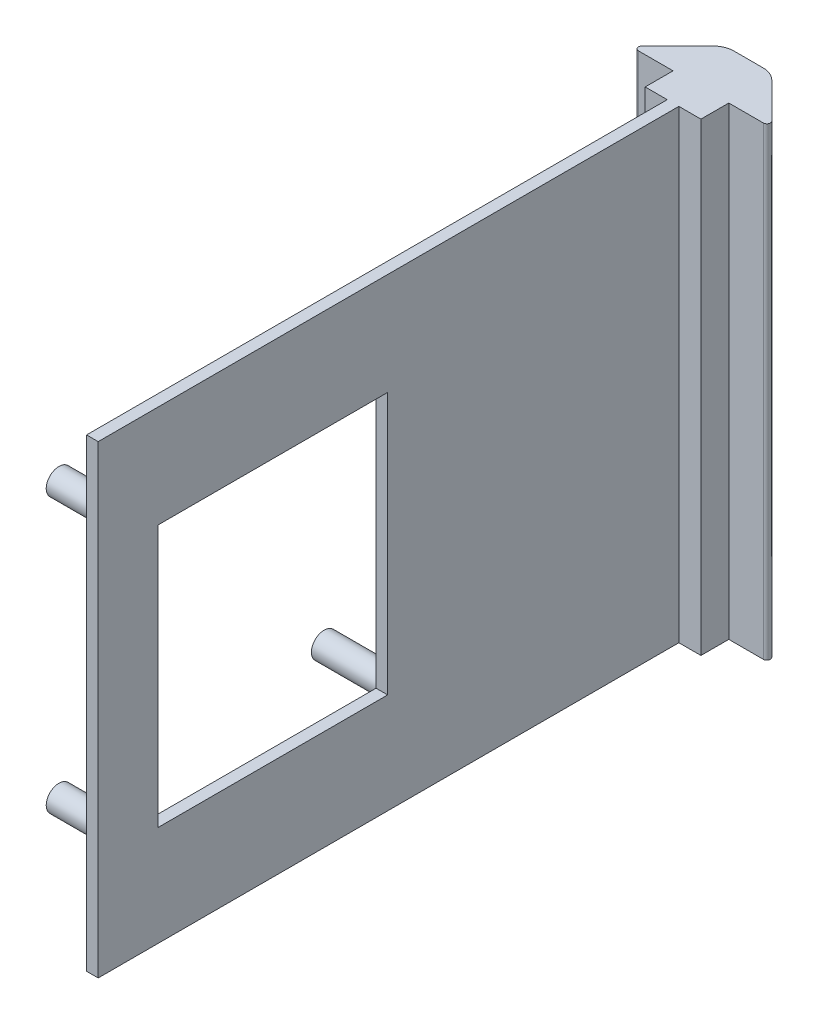
ISO-10303-21;
HEADER;
FILE_DESCRIPTION(('STEP AP214'),'2;1');
FILE_NAME('part.step','',(''),(''),'','','');
FILE_SCHEMA(('AUTOMOTIVE_DESIGN { 1 0 10303 214 1 1 1 1 }'));
ENDSEC;
DATA;
#1=APPLICATION_CONTEXT('core data for automotive mechanical design processes');
#2=APPLICATION_PROTOCOL_DEFINITION('international standard','automotive_design',2000,#1);
#3=PRODUCT_CONTEXT('',#1,'mechanical');
#4=PRODUCT('Part','Part','',(#3));
#5=PRODUCT_RELATED_PRODUCT_CATEGORY('part','',(#4));
#6=PRODUCT_DEFINITION_FORMATION('','',#4);
#7=PRODUCT_DEFINITION_CONTEXT('part definition',#1,'design');
#8=PRODUCT_DEFINITION('design','',#6,#7);
#9=PRODUCT_DEFINITION_SHAPE('','',#8);
#10=(LENGTH_UNIT() NAMED_UNIT(*) SI_UNIT(.MILLI.,.METRE.));
#11=(NAMED_UNIT(*) PLANE_ANGLE_UNIT() SI_UNIT($,.RADIAN.));
#12=(NAMED_UNIT(*) SI_UNIT($,.STERADIAN.) SOLID_ANGLE_UNIT());
#13=UNCERTAINTY_MEASURE_WITH_UNIT(LENGTH_MEASURE(1.E-05),#10,'distance_accuracy_value','');
#14=(GEOMETRIC_REPRESENTATION_CONTEXT(3) GLOBAL_UNCERTAINTY_ASSIGNED_CONTEXT((#13)) GLOBAL_UNIT_ASSIGNED_CONTEXT((#10,
#11,#12)) REPRESENTATION_CONTEXT('',''));
#15=CARTESIAN_POINT('',(0.,0.,0.));
#16=DIRECTION('',(0.,0.,1.));
#17=DIRECTION('',(1.,0.,0.));
#18=AXIS2_PLACEMENT_3D('',#15,#16,#17);
#19=CARTESIAN_POINT('',(-25.9846429608385,222.383078415329,86.0963149930729));
#20=DIRECTION('',(1.,0.,0.));
#21=DIRECTION('',(0.,0.,-1.));
#22=AXIS2_PLACEMENT_3D('',#19,#20,#21);
#23=PLANE('',#22);
#24=DIRECTION('',(0.,0.,-1.));
#25=VECTOR('',#24,1.);
#26=CARTESIAN_POINT('',(-25.9846429608385,273.183078415329,86.0963149930729));
#27=LINE('',#26,#25);
#28=CARTESIAN_POINT('',(-25.9846429608385,273.183078415329,86.0963149930729));
#29=VERTEX_POINT('',#28);
#30=CARTESIAN_POINT('',(-25.9846429608385,273.183078415329,22.5963149930729));
#31=VERTEX_POINT('',#30);
#32=EDGE_CURVE('E231',#29,#31,#27,.T.);
#33=ORIENTED_EDGE('',*,*,#32,.F.);
#34=DIRECTION('',(0.,1.,0.));
#35=VECTOR('',#34,1.);
#36=CARTESIAN_POINT('',(-25.9846429608385,222.383078415329,86.0963149930729));
#37=LINE('',#36,#35);
#38=CARTESIAN_POINT('',(-25.9846429608385,222.383078415329,86.0963149930729));
#39=VERTEX_POINT('',#38);
#40=EDGE_CURVE('E11',#39,#29,#37,.T.);
#41=ORIENTED_EDGE('',*,*,#40,.F.);
#42=DIRECTION('',(0.,0.,-1.));
#43=VECTOR('',#42,1.);
#44=CARTESIAN_POINT('',(-25.9846429608385,222.383078415329,86.0963149930729));
#45=LINE('',#44,#43);
#46=CARTESIAN_POINT('',(-25.9846429608385,222.383078415329,22.5963149930729));
#47=VERTEX_POINT('',#46);
#48=EDGE_CURVE('E234',#39,#47,#45,.T.);
#49=ORIENTED_EDGE('',*,*,#48,.T.);
#50=DIRECTION('',(0.,1.,0.));
#51=VECTOR('',#50,1.);
#52=CARTESIAN_POINT('',(-25.9846429608385,222.383078415329,22.5963149930729));
#53=LINE('',#52,#51);
#54=EDGE_CURVE('E40',#47,#31,#53,.T.);
#55=ORIENTED_EDGE('',*,*,#54,.T.);
#56=EDGE_LOOP('',(#33,#41,#49,#55));
#57=FACE_BOUND('',#56,.T.);
#58=DIRECTION('',(0.,0.,-1.));
#59=VECTOR('',#58,1.);
#60=CARTESIAN_POINT('',(-25.9846429608385,233.365269258809,86.0963149930729));
#61=LINE('',#60,#59);
#62=CARTESIAN_POINT('',(-25.9846429608385,233.365269258809,79.5497436559033));
#63=VERTEX_POINT('',#62);
#64=CARTESIAN_POINT('',(-25.9846429608385,233.365269258809,54.4397436559033));
#65=VERTEX_POINT('',#64);
#66=EDGE_CURVE('E204',#63,#65,#61,.T.);
#67=ORIENTED_EDGE('',*,*,#66,.F.);
#68=DIRECTION('',(0.,1.,0.));
#69=VECTOR('',#68,1.);
#70=CARTESIAN_POINT('',(-25.9846429608385,222.383078415329,79.5497436559033));
#71=LINE('',#70,#69);
#72=CARTESIAN_POINT('',(-25.9846429608385,262.015269258809,79.5497436559033));
#73=VERTEX_POINT('',#72);
#74=EDGE_CURVE('E206',#63,#73,#71,.T.);
#75=ORIENTED_EDGE('',*,*,#74,.T.);
#76=DIRECTION('',(0.,0.,-1.));
#77=VECTOR('',#76,1.);
#78=CARTESIAN_POINT('',(-25.9846429608385,262.015269258809,86.0963149930729));
#79=LINE('',#78,#77);
#80=CARTESIAN_POINT('',(-25.9846429608385,262.015269258809,54.4397436559033));
#81=VERTEX_POINT('',#80);
#82=EDGE_CURVE('E199',#73,#81,#79,.T.);
#83=ORIENTED_EDGE('',*,*,#82,.T.);
#84=DIRECTION('',(0.,1.,0.));
#85=VECTOR('',#84,1.);
#86=CARTESIAN_POINT('',(-25.9846429608385,222.383078415329,54.4397436559033));
#87=LINE('',#86,#85);
#88=EDGE_CURVE('E180',#65,#81,#87,.T.);
#89=ORIENTED_EDGE('',*,*,#88,.F.);
#90=EDGE_LOOP('',(#67,#75,#83,#89));
#91=FACE_BOUND('',#90,.T.);
#92=ADVANCED_FACE('F37',(#57,#91),#23,.T.);
#93=CARTESIAN_POINT('',(-27.2546429608385,222.383078415329,22.5963149930729));
#94=DIRECTION('',(-1.,0.,0.));
#95=DIRECTION('',(0.,0.,1.));
#96=AXIS2_PLACEMENT_3D('',#93,#94,#95);
#97=PLANE('',#96);
#98=CARTESIAN_POINT('',(-27.2546429608385,232.690269258809,81.4947436559033));
#99=DIRECTION('',(-1.,0.,0.));
#100=DIRECTION('',(0.,0.,1.));
#101=AXIS2_PLACEMENT_3D('',#98,#99,#100);
#102=CIRCLE('',#101,1.39700000000001);
#103=CARTESIAN_POINT('',(-27.2546429608385,232.690269258809,82.8917436559033));
#104=VERTEX_POINT('',#103);
#105=EDGE_CURVE('E210',#104,#104,#102,.T.);
#106=ORIENTED_EDGE('',*,*,#105,.F.);
#107=EDGE_LOOP('',(#106));
#108=FACE_BOUND('',#107,.T.);
#109=CARTESIAN_POINT('',(-27.2546429608385,262.69026925881,81.4947436559033));
#110=DIRECTION('',(-1.,0.,0.));
#111=DIRECTION('',(0.,0.,1.));
#112=AXIS2_PLACEMENT_3D('',#109,#110,#111);
#113=CIRCLE('',#112,1.39699999999998);
#114=CARTESIAN_POINT('',(-27.2546429608385,262.69026925881,82.8917436559033));
#115=VERTEX_POINT('',#114);
#116=EDGE_CURVE('E216',#115,#115,#113,.T.);
#117=ORIENTED_EDGE('',*,*,#116,.F.);
#118=EDGE_LOOP('',(#117));
#119=FACE_BOUND('',#118,.T.);
#120=CARTESIAN_POINT('',(-27.2546429608385,262.69026925881,52.4947436559033));
#121=DIRECTION('',(-1.,0.,0.));
#122=DIRECTION('',(0.,0.,1.));
#123=AXIS2_PLACEMENT_3D('',#120,#121,#122);
#124=CIRCLE('',#123,1.39699999999998);
#125=CARTESIAN_POINT('',(-27.2546429608385,262.69026925881,53.8917436559033));
#126=VERTEX_POINT('',#125);
#127=EDGE_CURVE('E222',#126,#126,#124,.T.);
#128=ORIENTED_EDGE('',*,*,#127,.F.);
#129=EDGE_LOOP('',(#128));
#130=FACE_BOUND('',#129,.T.);
#131=CARTESIAN_POINT('',(-27.2546429608385,232.690269258809,52.4947436559033));
#132=DIRECTION('',(-1.,0.,0.));
#133=DIRECTION('',(0.,0.,1.));
#134=AXIS2_PLACEMENT_3D('',#131,#132,#133);
#135=CIRCLE('',#134,1.397);
#136=CARTESIAN_POINT('',(-27.2546429608385,232.690269258809,53.8917436559033));
#137=VERTEX_POINT('',#136);
#138=EDGE_CURVE('E225',#137,#137,#135,.T.);
#139=ORIENTED_EDGE('',*,*,#138,.F.);
#140=EDGE_LOOP('',(#139));
#141=FACE_BOUND('',#140,.T.);
#142=DIRECTION('',(0.,0.,1.));
#143=VECTOR('',#142,1.);
#144=CARTESIAN_POINT('',(-27.2546429608385,273.183078415329,22.5963149930729));
#145=LINE('',#144,#143);
#146=CARTESIAN_POINT('',(-27.2546429608385,273.183078415329,22.5963149930729));
#147=VERTEX_POINT('',#146);
#148=CARTESIAN_POINT('',(-27.2546429608385,273.183078415329,86.0963149930729));
#149=VERTEX_POINT('',#148);
#150=EDGE_CURVE('E322',#147,#149,#145,.T.);
#151=ORIENTED_EDGE('',*,*,#150,.F.);
#152=DIRECTION('',(0.,1.,0.));
#153=VECTOR('',#152,1.);
#154=CARTESIAN_POINT('',(-27.2546429608385,222.383078415329,22.5963149930729));
#155=LINE('',#154,#153);
#156=CARTESIAN_POINT('',(-27.2546429608385,222.383078415329,22.5963149930729));
#157=VERTEX_POINT('',#156);
#158=EDGE_CURVE('E328',#157,#147,#155,.T.);
#159=ORIENTED_EDGE('',*,*,#158,.F.);
#160=DIRECTION('',(0.,0.,1.));
#161=VECTOR('',#160,1.);
#162=CARTESIAN_POINT('',(-27.2546429608385,222.383078415329,22.5963149930729));
#163=LINE('',#162,#161);
#164=CARTESIAN_POINT('',(-27.2546429608385,222.383078415329,86.0963149930729));
#165=VERTEX_POINT('',#164);
#166=EDGE_CURVE('E275',#157,#165,#163,.T.);
#167=ORIENTED_EDGE('',*,*,#166,.T.);
#168=DIRECTION('',(0.,1.,0.));
#169=VECTOR('',#168,1.);
#170=CARTESIAN_POINT('',(-27.2546429608385,222.383078415329,86.0963149930729));
#171=LINE('',#170,#169);
#172=EDGE_CURVE('E45',#165,#149,#171,.T.);
#173=ORIENTED_EDGE('',*,*,#172,.T.);
#174=EDGE_LOOP('',(#151,#159,#167,#173));
#175=FACE_BOUND('',#174,.T.);
#176=DIRECTION('',(0.,0.,1.));
#177=VECTOR('',#176,1.);
#178=CARTESIAN_POINT('',(-27.2546429608385,262.015269258809,0.));
#179=LINE('',#178,#177);
#180=CARTESIAN_POINT('',(-27.2546429608385,262.015269258809,54.4397436559033));
#181=VERTEX_POINT('',#180);
#182=CARTESIAN_POINT('',(-27.2546429608385,262.015269258809,79.5497436559033));
#183=VERTEX_POINT('',#182);
#184=EDGE_CURVE('E186',#181,#183,#179,.T.);
#185=ORIENTED_EDGE('',*,*,#184,.T.);
#186=DIRECTION('',(0.,-1.,0.));
#187=VECTOR('',#186,1.);
#188=CARTESIAN_POINT('',(-27.2546429608385,0.,79.5497436559033));
#189=LINE('',#188,#187);
#190=CARTESIAN_POINT('',(-27.2546429608385,233.365269258809,79.5497436559033));
#191=VERTEX_POINT('',#190);
#192=EDGE_CURVE('E61',#183,#191,#189,.T.);
#193=ORIENTED_EDGE('',*,*,#192,.T.);
#194=DIRECTION('',(0.,0.,1.));
#195=VECTOR('',#194,1.);
#196=CARTESIAN_POINT('',(-27.2546429608385,233.365269258809,0.));
#197=LINE('',#196,#195);
#198=CARTESIAN_POINT('',(-27.2546429608385,233.365269258809,54.4397436559033));
#199=VERTEX_POINT('',#198);
#200=EDGE_CURVE('E192',#199,#191,#197,.T.);
#201=ORIENTED_EDGE('',*,*,#200,.F.);
#202=DIRECTION('',(0.,-1.,0.));
#203=VECTOR('',#202,1.);
#204=CARTESIAN_POINT('',(-27.2546429608385,0.,54.4397436559034));
#205=LINE('',#204,#203);
#206=EDGE_CURVE('E177',#181,#199,#205,.T.);
#207=ORIENTED_EDGE('',*,*,#206,.F.);
#208=EDGE_LOOP('',(#185,#193,#201,#207));
#209=FACE_BOUND('',#208,.T.);
#210=ADVANCED_FACE('F190',(#108,#119,#130,#141,#175,#209),#97,.T.);
#211=CARTESIAN_POINT('',(-27.2546429608385,222.383078415329,86.0963149930729));
#212=DIRECTION('',(0.,0.,1.));
#213=DIRECTION('',(1.,0.,0.));
#214=AXIS2_PLACEMENT_3D('',#211,#212,#213);
#215=PLANE('',#214);
#216=DIRECTION('',(1.,0.,0.));
#217=VECTOR('',#216,1.);
#218=CARTESIAN_POINT('',(-27.2546429608385,273.183078415329,86.0963149930729));
#219=LINE('',#218,#217);
#220=EDGE_CURVE('E238',#149,#29,#219,.T.);
#221=ORIENTED_EDGE('',*,*,#220,.F.);
#222=ORIENTED_EDGE('',*,*,#172,.F.);
#223=DIRECTION('',(1.,0.,0.));
#224=VECTOR('',#223,1.);
#225=CARTESIAN_POINT('',(-27.2546429608385,222.383078415329,86.0963149930729));
#226=LINE('',#225,#224);
#227=EDGE_CURVE('E278',#165,#39,#226,.T.);
#228=ORIENTED_EDGE('',*,*,#227,.T.);
#229=ORIENTED_EDGE('',*,*,#40,.T.);
#230=EDGE_LOOP('',(#221,#222,#228,#229));
#231=FACE_BOUND('',#230,.T.);
#232=ADVANCED_FACE('F367',(#231),#215,.T.);
#233=CARTESIAN_POINT('',(-29.6676429608385,222.383078415329,22.5963149930729));
#234=DIRECTION('',(0.,0.,1.));
#235=DIRECTION('',(1.,0.,0.));
#236=AXIS2_PLACEMENT_3D('',#233,#234,#235);
#237=PLANE('',#236);
#238=DIRECTION('',(1.,0.,0.));
#239=VECTOR('',#238,1.);
#240=CARTESIAN_POINT('',(-29.6676429608385,273.183078415329,22.5963149930729));
#241=LINE('',#240,#239);
#242=CARTESIAN_POINT('',(-29.6676429608385,273.183078415329,22.5963149930729));
#243=VERTEX_POINT('',#242);
#244=EDGE_CURVE('E319',#243,#147,#241,.T.);
#245=ORIENTED_EDGE('',*,*,#244,.F.);
#246=DIRECTION('',(0.,1.,0.));
#247=VECTOR('',#246,1.);
#248=CARTESIAN_POINT('',(-29.6676429608385,222.383078415329,22.5963149930729));
#249=LINE('',#248,#247);
#250=CARTESIAN_POINT('',(-29.6676429608385,222.383078415329,22.5963149930729));
#251=VERTEX_POINT('',#250);
#252=EDGE_CURVE('E330',#251,#243,#249,.T.);
#253=ORIENTED_EDGE('',*,*,#252,.F.);
#254=DIRECTION('',(1.,0.,0.));
#255=VECTOR('',#254,1.);
#256=CARTESIAN_POINT('',(-29.6676429608385,222.383078415329,22.5963149930729));
#257=LINE('',#256,#255);
#258=EDGE_CURVE('E272',#251,#157,#257,.T.);
#259=ORIENTED_EDGE('',*,*,#258,.T.);
#260=ORIENTED_EDGE('',*,*,#158,.T.);
#261=EDGE_LOOP('',(#245,#253,#259,#260));
#262=FACE_BOUND('',#261,.T.);
#263=ADVANCED_FACE('F419',(#262),#237,.T.);
#264=CARTESIAN_POINT('',(-29.6676429608385,222.383078415329,22.3423149930729));
#265=DIRECTION('',(-1.,0.,0.));
#266=DIRECTION('',(0.,0.,1.));
#267=AXIS2_PLACEMENT_3D('',#264,#265,#266);
#268=PLANE('',#267);
#269=DIRECTION('',(0.,0.,1.));
#270=VECTOR('',#269,1.);
#271=CARTESIAN_POINT('',(-29.6676429608385,273.183078415329,22.3423149930729));
#272=LINE('',#271,#270);
#273=CARTESIAN_POINT('',(-29.6676429608385,273.183078415329,19.5483149930729));
#274=VERTEX_POINT('',#273);
#275=EDGE_CURVE('E316',#274,#243,#272,.T.);
#276=ORIENTED_EDGE('',*,*,#275,.F.);
#277=DIRECTION('',(0.,1.,0.));
#278=VECTOR('',#277,1.);
#279=CARTESIAN_POINT('',(-29.6676429608385,222.383078415329,19.5483149930729));
#280=LINE('',#279,#278);
#281=CARTESIAN_POINT('',(-29.6676429608385,222.383078415329,19.5483149930729));
#282=VERTEX_POINT('',#281);
#283=EDGE_CURVE('E332',#282,#274,#280,.T.);
#284=ORIENTED_EDGE('',*,*,#283,.F.);
#285=DIRECTION('',(0.,0.,1.));
#286=VECTOR('',#285,1.);
#287=CARTESIAN_POINT('',(-29.6676429608385,222.383078415329,22.3423149930729));
#288=LINE('',#287,#286);
#289=EDGE_CURVE('E270',#282,#251,#288,.T.);
#290=ORIENTED_EDGE('',*,*,#289,.T.);
#291=ORIENTED_EDGE('',*,*,#252,.T.);
#292=EDGE_LOOP('',(#276,#284,#290,#291));
#293=FACE_BOUND('',#292,.T.);
#294=ADVANCED_FACE('F414',(#293),#268,.T.);
#295=CARTESIAN_POINT('',(-29.6676429608385,222.383078415329,19.5483149930729));
#296=DIRECTION('',(0.,0.,1.));
#297=DIRECTION('',(1.,0.,0.));
#298=AXIS2_PLACEMENT_3D('',#295,#296,#297);
#299=PLANE('',#298);
#300=DIRECTION('',(1.,0.,0.));
#301=VECTOR('',#300,1.);
#302=CARTESIAN_POINT('',(-29.6676429608385,273.183078415329,19.5483149930729));
#303=LINE('',#302,#301);
#304=CARTESIAN_POINT('',(-33.4505661245178,273.183078415329,19.5483149930729));
#305=VERTEX_POINT('',#304);
#306=EDGE_CURVE('E313',#305,#274,#303,.T.);
#307=ORIENTED_EDGE('',*,*,#306,.F.);
#308=DIRECTION('',(0.,1.,0.));
#309=VECTOR('',#308,1.);
#310=CARTESIAN_POINT('',(-33.4505661245178,222.383078415329,19.5483149930729));
#311=LINE('',#310,#309);
#312=CARTESIAN_POINT('',(-33.4505661245178,222.383078415329,19.5483149930729));
#313=VERTEX_POINT('',#312);
#314=EDGE_CURVE('E335',#313,#305,#311,.T.);
#315=ORIENTED_EDGE('',*,*,#314,.F.);
#316=DIRECTION('',(1.,0.,0.));
#317=VECTOR('',#316,1.);
#318=CARTESIAN_POINT('',(-29.6676429608385,222.383078415329,19.5483149930729));
#319=LINE('',#318,#317);
#320=EDGE_CURVE('E267',#313,#282,#319,.T.);
#321=ORIENTED_EDGE('',*,*,#320,.T.);
#322=ORIENTED_EDGE('',*,*,#283,.T.);
#323=EDGE_LOOP('',(#307,#315,#321,#322));
#324=FACE_BOUND('',#323,.T.);
#325=ADVANCED_FACE('F411',(#324),#299,.T.);
#326=CARTESIAN_POINT('',(-33.4505661245178,222.383078415329,19.1673149930729));
#327=DIRECTION('',(0.,1.,0.));
#328=DIRECTION('',(0.,0.,1.));
#329=AXIS2_PLACEMENT_3D('',#326,#327,#328);
#330=CYLINDRICAL_SURFACE('',#329,0.381);
#331=CARTESIAN_POINT('',(-33.4505661245178,273.183078415329,19.1673149930729));
#332=DIRECTION('',(0.,1.,0.));
#333=DIRECTION('',(0.,0.,1.));
#334=AXIS2_PLACEMENT_3D('',#331,#332,#333);
#335=CIRCLE('',#334,0.381);
#336=CARTESIAN_POINT('',(-33.7199738081499,273.183078415329,18.8979073094408));
#337=VERTEX_POINT('',#336);
#338=EDGE_CURVE('E310',#337,#305,#335,.T.);
#339=ORIENTED_EDGE('',*,*,#338,.F.);
#340=DIRECTION('',(0.,1.,0.));
#341=VECTOR('',#340,1.);
#342=CARTESIAN_POINT('',(-33.7199738081499,222.383078415329,18.8979073094408));
#343=LINE('',#342,#341);
#344=CARTESIAN_POINT('',(-33.7199738081499,222.383078415329,18.8979073094408));
#345=VERTEX_POINT('',#344);
#346=EDGE_CURVE('E337',#345,#337,#343,.T.);
#347=ORIENTED_EDGE('',*,*,#346,.F.);
#348=CARTESIAN_POINT('',(-33.4505661245178,222.383078415329,19.1673149930729));
#349=DIRECTION('',(0.,1.,0.));
#350=DIRECTION('',(0.,0.,1.));
#351=AXIS2_PLACEMENT_3D('',#348,#349,#350);
#352=CIRCLE('',#351,0.381);
#353=EDGE_CURVE('E264',#345,#313,#352,.T.);
#354=ORIENTED_EDGE('',*,*,#353,.T.);
#355=ORIENTED_EDGE('',*,*,#314,.T.);
#356=EDGE_LOOP('',(#339,#347,#354,#355));
#357=FACE_BOUND('',#356,.T.);
#358=ADVANCED_FACE('F407',(#357),#330,.T.);
#359=CARTESIAN_POINT('',(-33.7199738081499,222.383078415329,18.8979073094408));
#360=DIRECTION('',(-0.707106781186548,0.,-0.707106781186547));
#361=DIRECTION('',(-0.707106781186547,0.,0.707106781186548));
#362=AXIS2_PLACEMENT_3D('',#359,#360,#361);
#363=PLANE('',#362);
#364=DIRECTION('',(-0.707106781186547,0.,0.707106781186548));
#365=VECTOR('',#364,1.);
#366=CARTESIAN_POINT('',(-33.7199738081499,273.183078415329,18.8979073094408));
#367=LINE('',#366,#365);
#368=CARTESIAN_POINT('',(-29.8329353899895,273.183078415329,15.0108688912804));
#369=VERTEX_POINT('',#368);
#370=EDGE_CURVE('E307',#369,#337,#367,.T.);
#371=ORIENTED_EDGE('',*,*,#370,.F.);
#372=DIRECTION('',(0.,1.,0.));
#373=VECTOR('',#372,1.);
#374=CARTESIAN_POINT('',(-29.8329353899895,222.383078415329,15.0108688912804));
#375=LINE('',#374,#373);
#376=CARTESIAN_POINT('',(-29.8329353899895,222.383078415329,15.0108688912804));
#377=VERTEX_POINT('',#376);
#378=EDGE_CURVE('E339',#377,#369,#375,.T.);
#379=ORIENTED_EDGE('',*,*,#378,.F.);
#380=DIRECTION('',(-0.707106781186547,0.,0.707106781186548));
#381=VECTOR('',#380,1.);
#382=CARTESIAN_POINT('',(-33.7199738081499,222.383078415329,18.8979073094408));
#383=LINE('',#382,#381);
#384=EDGE_CURVE('E261',#377,#345,#383,.T.);
#385=ORIENTED_EDGE('',*,*,#384,.T.);
#386=ORIENTED_EDGE('',*,*,#346,.T.);
#387=EDGE_LOOP('',(#371,#379,#385,#386));
#388=FACE_BOUND('',#387,.T.);
#389=ADVANCED_FACE('F403',(#388),#363,.T.);
#390=CARTESIAN_POINT('',(-28.216489288197,222.383078415329,16.6273149930729));
#391=DIRECTION('',(0.,1.,0.));
#392=DIRECTION('',(0.,0.,1.));
#393=AXIS2_PLACEMENT_3D('',#390,#391,#392);
#394=CYLINDRICAL_SURFACE('',#393,2.28600000000001);
#395=CARTESIAN_POINT('',(-28.216489288197,273.183078415329,16.6273149930729));
#396=DIRECTION('',(0.,1.,0.));
#397=DIRECTION('',(0.,0.,1.));
#398=AXIS2_PLACEMENT_3D('',#395,#396,#397);
#399=CIRCLE('',#398,2.28600000000001);
#400=CARTESIAN_POINT('',(-28.216489288197,273.183078415329,14.3413149930729));
#401=VERTEX_POINT('',#400);
#402=EDGE_CURVE('E304',#401,#369,#399,.T.);
#403=ORIENTED_EDGE('',*,*,#402,.F.);
#404=DIRECTION('',(0.,1.,0.));
#405=VECTOR('',#404,1.);
#406=CARTESIAN_POINT('',(-28.216489288197,222.383078415329,14.3413149930729));
#407=LINE('',#406,#405);
#408=CARTESIAN_POINT('',(-28.216489288197,222.383078415329,14.3413149930729));
#409=VERTEX_POINT('',#408);
#410=EDGE_CURVE('E341',#409,#401,#407,.T.);
#411=ORIENTED_EDGE('',*,*,#410,.F.);
#412=CARTESIAN_POINT('',(-28.216489288197,222.383078415329,16.6273149930729));
#413=DIRECTION('',(0.,1.,0.));
#414=DIRECTION('',(0.,0.,1.));
#415=AXIS2_PLACEMENT_3D('',#412,#413,#414);
#416=CIRCLE('',#415,2.28600000000001);
#417=EDGE_CURVE('E258',#409,#377,#416,.T.);
#418=ORIENTED_EDGE('',*,*,#417,.T.);
#419=ORIENTED_EDGE('',*,*,#378,.T.);
#420=EDGE_LOOP('',(#403,#411,#418,#419));
#421=FACE_BOUND('',#420,.T.);
#422=ADVANCED_FACE('F399',(#421),#394,.T.);
#423=CARTESIAN_POINT('',(-28.216489288197,222.383078415329,14.3413149930729));
#424=DIRECTION('',(0.,0.,-1.));
#425=DIRECTION('',(-1.,0.,0.));
#426=AXIS2_PLACEMENT_3D('',#423,#424,#425);
#427=PLANE('',#426);
#428=DIRECTION('',(-1.,0.,0.));
#429=VECTOR('',#428,1.);
#430=CARTESIAN_POINT('',(-28.216489288197,273.183078415329,14.3413149930729));
#431=LINE('',#430,#429);
#432=CARTESIAN_POINT('',(-25.02279663348,273.183078415329,14.3413149930729));
#433=VERTEX_POINT('',#432);
#434=EDGE_CURVE('E301',#433,#401,#431,.T.);
#435=ORIENTED_EDGE('',*,*,#434,.F.);
#436=DIRECTION('',(0.,1.,0.));
#437=VECTOR('',#436,1.);
#438=CARTESIAN_POINT('',(-25.02279663348,222.383078415329,14.3413149930729));
#439=LINE('',#438,#437);
#440=CARTESIAN_POINT('',(-25.02279663348,222.383078415329,14.3413149930729));
#441=VERTEX_POINT('',#440);
#442=EDGE_CURVE('E343',#441,#433,#439,.T.);
#443=ORIENTED_EDGE('',*,*,#442,.F.);
#444=DIRECTION('',(-1.,0.,0.));
#445=VECTOR('',#444,1.);
#446=CARTESIAN_POINT('',(-28.216489288197,222.383078415329,14.3413149930729));
#447=LINE('',#446,#445);
#448=EDGE_CURVE('E255',#441,#409,#447,.T.);
#449=ORIENTED_EDGE('',*,*,#448,.T.);
#450=ORIENTED_EDGE('',*,*,#410,.T.);
#451=EDGE_LOOP('',(#435,#443,#449,#450));
#452=FACE_BOUND('',#451,.T.);
#453=ADVANCED_FACE('F395',(#452),#427,.T.);
#454=CARTESIAN_POINT('',(-25.02279663348,222.383078415329,16.6273149930729));
#455=DIRECTION('',(0.,1.,0.));
#456=DIRECTION('',(0.,0.,1.));
#457=AXIS2_PLACEMENT_3D('',#454,#455,#456);
#458=CYLINDRICAL_SURFACE('',#457,2.28600000000002);
#459=CARTESIAN_POINT('',(-25.02279663348,273.183078415329,16.6273149930729));
#460=DIRECTION('',(0.,1.,0.));
#461=DIRECTION('',(0.,0.,1.));
#462=AXIS2_PLACEMENT_3D('',#459,#460,#461);
#463=CIRCLE('',#462,2.28600000000002);
#464=CARTESIAN_POINT('',(-23.4063505316876,273.183078415329,15.0108688912804));
#465=VERTEX_POINT('',#464);
#466=EDGE_CURVE('E298',#465,#433,#463,.T.);
#467=ORIENTED_EDGE('',*,*,#466,.F.);
#468=DIRECTION('',(0.,1.,0.));
#469=VECTOR('',#468,1.);
#470=CARTESIAN_POINT('',(-23.4063505316876,222.383078415329,15.0108688912804));
#471=LINE('',#470,#469);
#472=CARTESIAN_POINT('',(-23.4063505316876,222.383078415329,15.0108688912804));
#473=VERTEX_POINT('',#472);
#474=EDGE_CURVE('E345',#473,#465,#471,.T.);
#475=ORIENTED_EDGE('',*,*,#474,.F.);
#476=CARTESIAN_POINT('',(-25.02279663348,222.383078415329,16.6273149930729));
#477=DIRECTION('',(0.,1.,0.));
#478=DIRECTION('',(0.,0.,1.));
#479=AXIS2_PLACEMENT_3D('',#476,#477,#478);
#480=CIRCLE('',#479,2.28600000000002);
#481=EDGE_CURVE('E252',#473,#441,#480,.T.);
#482=ORIENTED_EDGE('',*,*,#481,.T.);
#483=ORIENTED_EDGE('',*,*,#442,.T.);
#484=EDGE_LOOP('',(#467,#475,#482,#483));
#485=FACE_BOUND('',#484,.T.);
#486=ADVANCED_FACE('F391',(#485),#458,.T.);
#487=CARTESIAN_POINT('',(-23.4063505316876,222.383078415329,15.0108688912804));
#488=DIRECTION('',(0.707106781186551,0.,-0.707106781186544));
#489=DIRECTION('',(-0.707106781186544,0.,-0.707106781186551));
#490=AXIS2_PLACEMENT_3D('',#487,#488,#489);
#491=PLANE('',#490);
#492=DIRECTION('',(-0.707106781186544,0.,-0.707106781186551));
#493=VECTOR('',#492,1.);
#494=CARTESIAN_POINT('',(-23.4063505316876,273.183078415329,15.0108688912804));
#495=LINE('',#494,#493);
#496=CARTESIAN_POINT('',(-19.5193121135272,273.183078415329,18.8979073094408));
#497=VERTEX_POINT('',#496);
#498=EDGE_CURVE('E295',#497,#465,#495,.T.);
#499=ORIENTED_EDGE('',*,*,#498,.F.);
#500=DIRECTION('',(0.,1.,0.));
#501=VECTOR('',#500,1.);
#502=CARTESIAN_POINT('',(-19.5193121135272,222.383078415329,18.8979073094408));
#503=LINE('',#502,#501);
#504=CARTESIAN_POINT('',(-19.5193121135272,222.383078415329,18.8979073094408));
#505=VERTEX_POINT('',#504);
#506=EDGE_CURVE('E347',#505,#497,#503,.T.);
#507=ORIENTED_EDGE('',*,*,#506,.F.);
#508=DIRECTION('',(-0.707106781186544,0.,-0.707106781186551));
#509=VECTOR('',#508,1.);
#510=CARTESIAN_POINT('',(-23.4063505316876,222.383078415329,15.0108688912804));
#511=LINE('',#510,#509);
#512=EDGE_CURVE('E249',#505,#473,#511,.T.);
#513=ORIENTED_EDGE('',*,*,#512,.T.);
#514=ORIENTED_EDGE('',*,*,#474,.T.);
#515=EDGE_LOOP('',(#499,#507,#513,#514));
#516=FACE_BOUND('',#515,.T.);
#517=ADVANCED_FACE('F387',(#516),#491,.T.);
#518=CARTESIAN_POINT('',(-19.7887197971593,222.383078415329,19.1673149930729));
#519=DIRECTION('',(0.,1.,0.));
#520=DIRECTION('',(0.,0.,1.));
#521=AXIS2_PLACEMENT_3D('',#518,#519,#520);
#522=CYLINDRICAL_SURFACE('',#521,0.380999999999995);
#523=CARTESIAN_POINT('',(-19.7887197971593,273.183078415329,19.1673149930729));
#524=DIRECTION('',(0.,1.,0.));
#525=DIRECTION('',(0.,0.,1.));
#526=AXIS2_PLACEMENT_3D('',#523,#524,#525);
#527=CIRCLE('',#526,0.380999999999995);
#528=CARTESIAN_POINT('',(-19.7887197971593,273.183078415329,19.5483149930729));
#529=VERTEX_POINT('',#528);
#530=EDGE_CURVE('E292',#529,#497,#527,.T.);
#531=ORIENTED_EDGE('',*,*,#530,.F.);
#532=DIRECTION('',(0.,1.,0.));
#533=VECTOR('',#532,1.);
#534=CARTESIAN_POINT('',(-19.7887197971593,222.383078415329,19.5483149930729));
#535=LINE('',#534,#533);
#536=CARTESIAN_POINT('',(-19.7887197971593,222.383078415329,19.5483149930729));
#537=VERTEX_POINT('',#536);
#538=EDGE_CURVE('E349',#537,#529,#535,.T.);
#539=ORIENTED_EDGE('',*,*,#538,.F.);
#540=CARTESIAN_POINT('',(-19.7887197971593,222.383078415329,19.1673149930729));
#541=DIRECTION('',(0.,1.,0.));
#542=DIRECTION('',(0.,0.,1.));
#543=AXIS2_PLACEMENT_3D('',#540,#541,#542);
#544=CIRCLE('',#543,0.380999999999995);
#545=EDGE_CURVE('E246',#537,#505,#544,.T.);
#546=ORIENTED_EDGE('',*,*,#545,.T.);
#547=ORIENTED_EDGE('',*,*,#506,.T.);
#548=EDGE_LOOP('',(#531,#539,#546,#547));
#549=FACE_BOUND('',#548,.T.);
#550=ADVANCED_FACE('F384',(#549),#522,.T.);
#551=CARTESIAN_POINT('',(-19.7887197971593,222.383078415329,19.5483149930729));
#552=DIRECTION('',(0.,0.,1.));
#553=DIRECTION('',(1.,0.,0.));
#554=AXIS2_PLACEMENT_3D('',#551,#552,#553);
#555=PLANE('',#554);
#556=DIRECTION('',(1.,0.,0.));
#557=VECTOR('',#556,1.);
#558=CARTESIAN_POINT('',(-19.7887197971593,273.183078415329,19.5483149930729));
#559=LINE('',#558,#557);
#560=CARTESIAN_POINT('',(-23.5716429608385,273.183078415329,19.5483149930729));
#561=VERTEX_POINT('',#560);
#562=EDGE_CURVE('E289',#561,#529,#559,.T.);
#563=ORIENTED_EDGE('',*,*,#562,.F.);
#564=DIRECTION('',(0.,1.,0.));
#565=VECTOR('',#564,1.);
#566=CARTESIAN_POINT('',(-23.5716429608385,222.383078415329,19.5483149930729));
#567=LINE('',#566,#565);
#568=CARTESIAN_POINT('',(-23.5716429608385,222.383078415329,19.5483149930729));
#569=VERTEX_POINT('',#568);
#570=EDGE_CURVE('E351',#569,#561,#567,.T.);
#571=ORIENTED_EDGE('',*,*,#570,.F.);
#572=DIRECTION('',(1.,0.,0.));
#573=VECTOR('',#572,1.);
#574=CARTESIAN_POINT('',(-19.7887197971593,222.383078415329,19.5483149930729));
#575=LINE('',#574,#573);
#576=EDGE_CURVE('E243',#569,#537,#575,.T.);
#577=ORIENTED_EDGE('',*,*,#576,.T.);
#578=ORIENTED_EDGE('',*,*,#538,.T.);
#579=EDGE_LOOP('',(#563,#571,#577,#578));
#580=FACE_BOUND('',#579,.T.);
#581=ADVANCED_FACE('F380',(#580),#555,.T.);
#582=CARTESIAN_POINT('',(-23.5716429608385,222.383078415329,19.5483149930729));
#583=DIRECTION('',(1.,0.,0.));
#584=DIRECTION('',(0.,0.,-1.));
#585=AXIS2_PLACEMENT_3D('',#582,#583,#584);
#586=PLANE('',#585);
#587=DIRECTION('',(0.,0.,-1.));
#588=VECTOR('',#587,1.);
#589=CARTESIAN_POINT('',(-23.5716429608385,273.183078415329,19.5483149930729));
#590=LINE('',#589,#588);
#591=CARTESIAN_POINT('',(-23.5716429608385,273.183078415329,22.5963149930729));
#592=VERTEX_POINT('',#591);
#593=EDGE_CURVE('E286',#592,#561,#590,.T.);
#594=ORIENTED_EDGE('',*,*,#593,.F.);
#595=DIRECTION('',(0.,1.,0.));
#596=VECTOR('',#595,1.);
#597=CARTESIAN_POINT('',(-23.5716429608385,222.383078415329,22.5963149930729));
#598=LINE('',#597,#596);
#599=CARTESIAN_POINT('',(-23.5716429608385,222.383078415329,22.5963149930729));
#600=VERTEX_POINT('',#599);
#601=EDGE_CURVE('E352',#600,#592,#598,.T.);
#602=ORIENTED_EDGE('',*,*,#601,.F.);
#603=DIRECTION('',(0.,0.,-1.));
#604=VECTOR('',#603,1.);
#605=CARTESIAN_POINT('',(-23.5716429608385,222.383078415329,22.5963149930729));
#606=LINE('',#605,#604);
#607=EDGE_CURVE('E241',#600,#569,#606,.T.);
#608=ORIENTED_EDGE('',*,*,#607,.T.);
#609=ORIENTED_EDGE('',*,*,#570,.T.);
#610=EDGE_LOOP('',(#594,#602,#608,#609));
#611=FACE_BOUND('',#610,.T.);
#612=ADVANCED_FACE('F377',(#611),#586,.T.);
#613=CARTESIAN_POINT('',(-25.9846429608385,222.383078415329,22.5963149930729));
#614=DIRECTION('',(0.,0.,1.));
#615=DIRECTION('',(1.,0.,0.));
#616=AXIS2_PLACEMENT_3D('',#613,#614,#615);
#617=PLANE('',#616);
#618=DIRECTION('',(1.,0.,0.));
#619=VECTOR('',#618,1.);
#620=CARTESIAN_POINT('',(-25.9846429608385,273.183078415329,22.5963149930729));
#621=LINE('',#620,#619);
#622=EDGE_CURVE('E283',#31,#592,#621,.T.);
#623=ORIENTED_EDGE('',*,*,#622,.F.);
#624=ORIENTED_EDGE('',*,*,#54,.F.);
#625=DIRECTION('',(1.,0.,0.));
#626=VECTOR('',#625,1.);
#627=CARTESIAN_POINT('',(-25.9846429608385,222.383078415329,22.5963149930729));
#628=LINE('',#627,#626);
#629=EDGE_CURVE('E237',#47,#600,#628,.T.);
#630=ORIENTED_EDGE('',*,*,#629,.T.);
#631=ORIENTED_EDGE('',*,*,#601,.T.);
#632=EDGE_LOOP('',(#623,#624,#630,#631));
#633=FACE_BOUND('',#632,.T.);
#634=ADVANCED_FACE('F361',(#633),#617,.T.);
#635=CARTESIAN_POINT('',(-19.7887197971593,222.383078415329,19.1673149930729));
#636=DIRECTION('',(0.,1.,0.));
#637=DIRECTION('',(0.,0.,1.));
#638=AXIS2_PLACEMENT_3D('',#635,#636,#637);
#639=PLANE('',#638);
#640=ORIENTED_EDGE('',*,*,#48,.F.);
#641=ORIENTED_EDGE('',*,*,#227,.F.);
#642=ORIENTED_EDGE('',*,*,#166,.F.);
#643=ORIENTED_EDGE('',*,*,#258,.F.);
#644=ORIENTED_EDGE('',*,*,#289,.F.);
#645=ORIENTED_EDGE('',*,*,#320,.F.);
#646=ORIENTED_EDGE('',*,*,#353,.F.);
#647=ORIENTED_EDGE('',*,*,#384,.F.);
#648=ORIENTED_EDGE('',*,*,#417,.F.);
#649=ORIENTED_EDGE('',*,*,#448,.F.);
#650=ORIENTED_EDGE('',*,*,#481,.F.);
#651=ORIENTED_EDGE('',*,*,#512,.F.);
#652=ORIENTED_EDGE('',*,*,#545,.F.);
#653=ORIENTED_EDGE('',*,*,#576,.F.);
#654=ORIENTED_EDGE('',*,*,#607,.F.);
#655=ORIENTED_EDGE('',*,*,#629,.F.);
#656=EDGE_LOOP('',(#640,#641,#642,#643,#644,#645,#646,#647,#648,#649,#650,#651,#652,#653,#654,#655));
#657=FACE_BOUND('',#656,.T.);
#658=ADVANCED_FACE('F370',(#657),#639,.F.);
#659=CARTESIAN_POINT('',(-19.7887197971593,273.183078415329,19.1673149930729));
#660=DIRECTION('',(0.,1.,0.));
#661=DIRECTION('',(0.,0.,1.));
#662=AXIS2_PLACEMENT_3D('',#659,#660,#661);
#663=PLANE('',#662);
#664=ORIENTED_EDGE('',*,*,#32,.T.);
#665=ORIENTED_EDGE('',*,*,#622,.T.);
#666=ORIENTED_EDGE('',*,*,#593,.T.);
#667=ORIENTED_EDGE('',*,*,#562,.T.);
#668=ORIENTED_EDGE('',*,*,#530,.T.);
#669=ORIENTED_EDGE('',*,*,#498,.T.);
#670=ORIENTED_EDGE('',*,*,#466,.T.);
#671=ORIENTED_EDGE('',*,*,#434,.T.);
#672=ORIENTED_EDGE('',*,*,#402,.T.);
#673=ORIENTED_EDGE('',*,*,#370,.T.);
#674=ORIENTED_EDGE('',*,*,#338,.T.);
#675=ORIENTED_EDGE('',*,*,#306,.T.);
#676=ORIENTED_EDGE('',*,*,#275,.T.);
#677=ORIENTED_EDGE('',*,*,#244,.T.);
#678=ORIENTED_EDGE('',*,*,#150,.T.);
#679=ORIENTED_EDGE('',*,*,#220,.T.);
#680=EDGE_LOOP('',(#664,#665,#666,#667,#668,#669,#670,#671,#672,#673,#674,#675,#676,#677,#678,#679));
#681=FACE_BOUND('',#680,.T.);
#682=ADVANCED_FACE('F363',(#681),#663,.T.);
#683=CARTESIAN_POINT('',(-34.8746429608385,232.690269258809,52.4947436559033));
#684=DIRECTION('',(1.,0.,0.));
#685=DIRECTION('',(0.,0.,-1.));
#686=AXIS2_PLACEMENT_3D('',#683,#684,#685);
#687=CYLINDRICAL_SURFACE('',#686,1.397);
#688=CARTESIAN_POINT('',(-34.8746429608385,232.690269258809,52.4947436559033));
#689=DIRECTION('',(-1.,0.,0.));
#690=DIRECTION('',(0.,0.,1.));
#691=AXIS2_PLACEMENT_3D('',#688,#689,#690);
#692=CIRCLE('',#691,1.397);
#693=CARTESIAN_POINT('',(-34.8746429608385,232.690269258809,53.8917436559033));
#694=VERTEX_POINT('',#693);
#695=EDGE_CURVE('E228',#694,#694,#692,.T.);
#696=ORIENTED_EDGE('',*,*,#695,.F.);
#697=EDGE_LOOP('',(#696));
#698=FACE_BOUND('',#697,.T.);
#699=ORIENTED_EDGE('',*,*,#138,.T.);
#700=EDGE_LOOP('',(#699));
#701=FACE_BOUND('',#700,.T.);
#702=ADVANCED_FACE('F464',(#698,#701),#687,.T.);
#703=CARTESIAN_POINT('',(-34.8746429608385,0.,0.));
#704=DIRECTION('',(-1.,0.,0.));
#705=DIRECTION('',(0.,0.,1.));
#706=AXIS2_PLACEMENT_3D('',#703,#704,#705);
#707=PLANE('',#706);
#708=ORIENTED_EDGE('',*,*,#695,.T.);
#709=EDGE_LOOP('',(#708));
#710=FACE_BOUND('',#709,.T.);
#711=ADVANCED_FACE('F468',(#710),#707,.T.);
#712=CARTESIAN_POINT('',(-34.8746429608385,262.69026925881,52.4947436559033));
#713=DIRECTION('',(1.,0.,0.));
#714=DIRECTION('',(0.,0.,-1.));
#715=AXIS2_PLACEMENT_3D('',#712,#713,#714);
#716=CYLINDRICAL_SURFACE('',#715,1.39699999999998);
#717=CARTESIAN_POINT('',(-34.8746429608385,262.69026925881,52.4947436559033));
#718=DIRECTION('',(-1.,0.,0.));
#719=DIRECTION('',(0.,0.,1.));
#720=AXIS2_PLACEMENT_3D('',#717,#718,#719);
#721=CIRCLE('',#720,1.39699999999998);
#722=CARTESIAN_POINT('',(-34.8746429608385,262.69026925881,53.8917436559033));
#723=VERTEX_POINT('',#722);
#724=EDGE_CURVE('E219',#723,#723,#721,.T.);
#725=ORIENTED_EDGE('',*,*,#724,.F.);
#726=EDGE_LOOP('',(#725));
#727=FACE_BOUND('',#726,.T.);
#728=ORIENTED_EDGE('',*,*,#127,.T.);
#729=EDGE_LOOP('',(#728));
#730=FACE_BOUND('',#729,.T.);
#731=ADVANCED_FACE('F472',(#727,#730),#716,.T.);
#732=CARTESIAN_POINT('',(-34.8746429608385,262.69026925881,52.4947436559033));
#733=DIRECTION('',(-1.,0.,0.));
#734=DIRECTION('',(0.,0.,1.));
#735=AXIS2_PLACEMENT_3D('',#732,#733,#734);
#736=PLANE('',#735);
#737=ORIENTED_EDGE('',*,*,#724,.T.);
#738=EDGE_LOOP('',(#737));
#739=FACE_BOUND('',#738,.T.);
#740=ADVANCED_FACE('F474',(#739),#736,.T.);
#741=CARTESIAN_POINT('',(-34.8746429608385,262.69026925881,81.4947436559033));
#742=DIRECTION('',(1.,0.,0.));
#743=DIRECTION('',(0.,0.,-1.));
#744=AXIS2_PLACEMENT_3D('',#741,#742,#743);
#745=CYLINDRICAL_SURFACE('',#744,1.39699999999998);
#746=CARTESIAN_POINT('',(-34.8746429608385,262.69026925881,81.4947436559033));
#747=DIRECTION('',(-1.,0.,0.));
#748=DIRECTION('',(0.,0.,1.));
#749=AXIS2_PLACEMENT_3D('',#746,#747,#748);
#750=CIRCLE('',#749,1.39699999999998);
#751=CARTESIAN_POINT('',(-34.8746429608385,262.69026925881,82.8917436559033));
#752=VERTEX_POINT('',#751);
#753=EDGE_CURVE('E213',#752,#752,#750,.T.);
#754=ORIENTED_EDGE('',*,*,#753,.F.);
#755=EDGE_LOOP('',(#754));
#756=FACE_BOUND('',#755,.T.);
#757=ORIENTED_EDGE('',*,*,#116,.T.);
#758=EDGE_LOOP('',(#757));
#759=FACE_BOUND('',#758,.T.);
#760=ADVANCED_FACE('F477',(#756,#759),#745,.T.);
#761=CARTESIAN_POINT('',(-34.8746429608385,262.69026925881,81.4947436559033));
#762=DIRECTION('',(-1.,0.,0.));
#763=DIRECTION('',(0.,0.,1.));
#764=AXIS2_PLACEMENT_3D('',#761,#762,#763);
#765=PLANE('',#764);
#766=ORIENTED_EDGE('',*,*,#753,.T.);
#767=EDGE_LOOP('',(#766));
#768=FACE_BOUND('',#767,.T.);
#769=ADVANCED_FACE('F482',(#768),#765,.T.);
#770=CARTESIAN_POINT('',(-34.8746429608385,232.690269258809,81.4947436559033));
#771=DIRECTION('',(1.,0.,0.));
#772=DIRECTION('',(0.,0.,-1.));
#773=AXIS2_PLACEMENT_3D('',#770,#771,#772);
#774=CYLINDRICAL_SURFACE('',#773,1.39700000000001);
#775=CARTESIAN_POINT('',(-34.8746429608385,232.690269258809,81.4947436559033));
#776=DIRECTION('',(-1.,0.,0.));
#777=DIRECTION('',(0.,0.,1.));
#778=AXIS2_PLACEMENT_3D('',#775,#776,#777);
#779=CIRCLE('',#778,1.39700000000001);
#780=CARTESIAN_POINT('',(-34.8746429608385,232.690269258809,82.8917436559033));
#781=VERTEX_POINT('',#780);
#782=EDGE_CURVE('E209',#781,#781,#779,.T.);
#783=ORIENTED_EDGE('',*,*,#782,.F.);
#784=EDGE_LOOP('',(#783));
#785=FACE_BOUND('',#784,.T.);
#786=ORIENTED_EDGE('',*,*,#105,.T.);
#787=EDGE_LOOP('',(#786));
#788=FACE_BOUND('',#787,.T.);
#789=ADVANCED_FACE('F485',(#785,#788),#774,.T.);
#790=CARTESIAN_POINT('',(-34.8746429608385,232.690269258809,81.4947436559033));
#791=DIRECTION('',(-1.,0.,0.));
#792=DIRECTION('',(0.,0.,1.));
#793=AXIS2_PLACEMENT_3D('',#790,#791,#792);
#794=PLANE('',#793);
#795=ORIENTED_EDGE('',*,*,#782,.T.);
#796=EDGE_LOOP('',(#795));
#797=FACE_BOUND('',#796,.T.);
#798=ADVANCED_FACE('F490',(#797),#794,.T.);
#799=CARTESIAN_POINT('',(-19.4077197971593,0.,79.5497436559033));
#800=DIRECTION('',(0.,0.,-1.));
#801=DIRECTION('',(-1.,0.,0.));
#802=AXIS2_PLACEMENT_3D('',#799,#800,#801);
#803=PLANE('',#802);
#804=DIRECTION('',(-1.,0.,0.));
#805=VECTOR('',#804,1.);
#806=CARTESIAN_POINT('',(-19.4077197971593,233.365269258809,79.5497436559033));
#807=LINE('',#806,#805);
#808=EDGE_CURVE('E197',#63,#191,#807,.T.);
#809=ORIENTED_EDGE('',*,*,#808,.T.);
#810=ORIENTED_EDGE('',*,*,#192,.F.);
#811=DIRECTION('',(-1.,0.,0.));
#812=VECTOR('',#811,1.);
#813=CARTESIAN_POINT('',(-19.4077197971593,262.015269258809,79.5497436559033));
#814=LINE('',#813,#812);
#815=EDGE_CURVE('E183',#73,#183,#814,.T.);
#816=ORIENTED_EDGE('',*,*,#815,.F.);
#817=ORIENTED_EDGE('',*,*,#74,.F.);
#818=EDGE_LOOP('',(#809,#810,#816,#817));
#819=FACE_BOUND('',#818,.T.);
#820=ADVANCED_FACE('F493',(#819),#803,.T.);
#821=CARTESIAN_POINT('',(-19.4077197971593,233.365269258809,0.));
#822=DIRECTION('',(0.,-1.,0.));
#823=DIRECTION('',(0.,0.,-1.));
#824=AXIS2_PLACEMENT_3D('',#821,#822,#823);
#825=PLANE('',#824);
#826=ORIENTED_EDGE('',*,*,#66,.T.);
#827=DIRECTION('',(-1.,0.,0.));
#828=VECTOR('',#827,1.);
#829=CARTESIAN_POINT('',(-19.4077197971593,233.365269258809,54.4397436559033));
#830=LINE('',#829,#828);
#831=EDGE_CURVE('E182',#65,#199,#830,.T.);
#832=ORIENTED_EDGE('',*,*,#831,.T.);
#833=ORIENTED_EDGE('',*,*,#200,.T.);
#834=ORIENTED_EDGE('',*,*,#808,.F.);
#835=EDGE_LOOP('',(#826,#832,#833,#834));
#836=FACE_BOUND('',#835,.T.);
#837=ADVANCED_FACE('F500',(#836),#825,.F.);
#838=CARTESIAN_POINT('',(-19.4077197971593,0.,54.4397436559034));
#839=DIRECTION('',(0.,0.,-1.));
#840=DIRECTION('',(0.,1.,0.));
#841=AXIS2_PLACEMENT_3D('',#838,#839,#840);
#842=PLANE('',#841);
#843=ORIENTED_EDGE('',*,*,#88,.T.);
#844=DIRECTION('',(-1.,0.,0.));
#845=VECTOR('',#844,1.);
#846=CARTESIAN_POINT('',(-19.4077197971593,262.015269258809,54.4397436559033));
#847=LINE('',#846,#845);
#848=EDGE_CURVE('E53',#81,#181,#847,.T.);
#849=ORIENTED_EDGE('',*,*,#848,.T.);
#850=ORIENTED_EDGE('',*,*,#206,.T.);
#851=ORIENTED_EDGE('',*,*,#831,.F.);
#852=EDGE_LOOP('',(#843,#849,#850,#851));
#853=FACE_BOUND('',#852,.T.);
#854=ADVANCED_FACE('F174',(#853),#842,.F.);
#855=CARTESIAN_POINT('',(-19.4077197971593,262.015269258809,0.));
#856=DIRECTION('',(0.,-1.,0.));
#857=DIRECTION('',(0.,0.,-1.));
#858=AXIS2_PLACEMENT_3D('',#855,#856,#857);
#859=PLANE('',#858);
#860=ORIENTED_EDGE('',*,*,#815,.T.);
#861=ORIENTED_EDGE('',*,*,#184,.F.);
#862=ORIENTED_EDGE('',*,*,#848,.F.);
#863=ORIENTED_EDGE('',*,*,#82,.F.);
#864=EDGE_LOOP('',(#860,#861,#862,#863));
#865=FACE_BOUND('',#864,.T.);
#866=ADVANCED_FACE('F187',(#865),#859,.T.);
#867=CLOSED_SHELL('',(#92,#210,#232,#263,#294,#325,#358,#389,#422,#453,#486,#517,#550,#581,#612,
#634,#658,#682,#702,#711,#731,#740,#760,#769,#789,#798,#820,#837,#854,#866));
#868=MANIFOLD_SOLID_BREP('B2',#867);
#869=ADVANCED_BREP_SHAPE_REPRESENTATION('',(#18,#868),#14);
#870=SHAPE_DEFINITION_REPRESENTATION(#9,#869);
ENDSEC;
END-ISO-10303-21;
